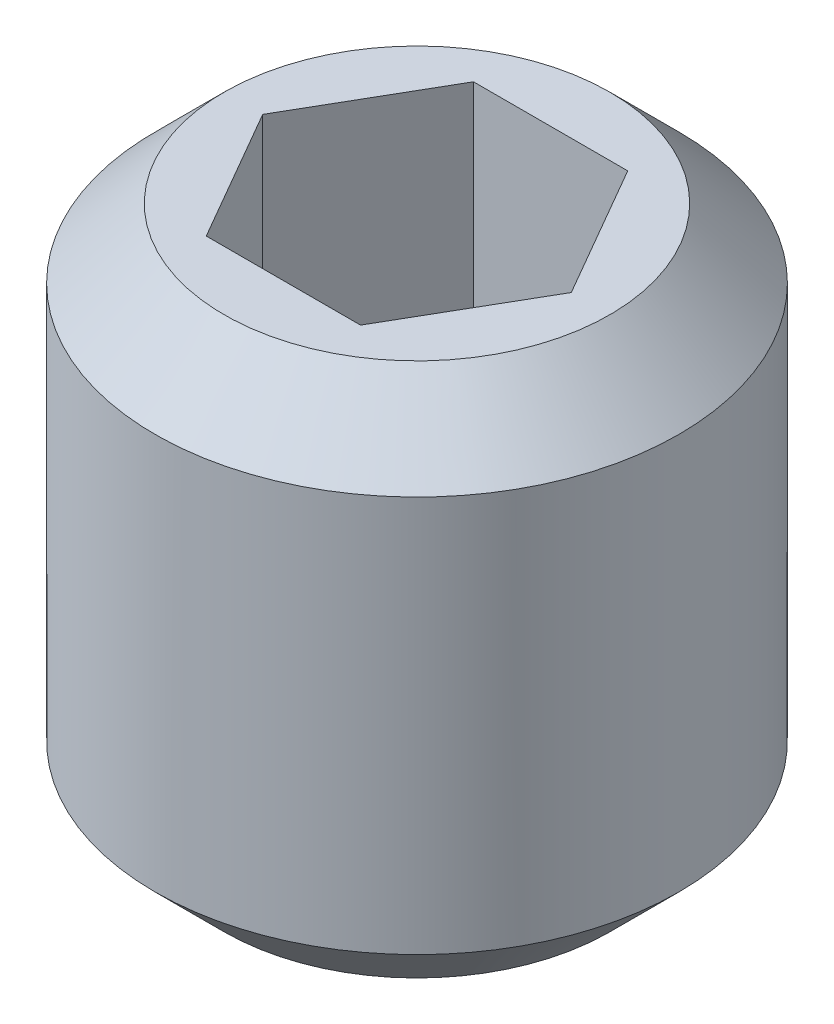
ISO-10303-21;
HEADER;
FILE_DESCRIPTION(('STEP AP214'),'2;1');
FILE_NAME('part.step','',(''),(''),'','','');
FILE_SCHEMA(('AUTOMOTIVE_DESIGN { 1 0 10303 214 1 1 1 1 }'));
ENDSEC;
DATA;
#1=APPLICATION_CONTEXT('core data for automotive mechanical design processes');
#2=APPLICATION_PROTOCOL_DEFINITION('international standard','automotive_design',2000,#1);
#3=PRODUCT_CONTEXT('',#1,'mechanical');
#4=PRODUCT('Part','Part','',(#3));
#5=PRODUCT_RELATED_PRODUCT_CATEGORY('part','',(#4));
#6=PRODUCT_DEFINITION_FORMATION('','',#4);
#7=PRODUCT_DEFINITION_CONTEXT('part definition',#1,'design');
#8=PRODUCT_DEFINITION('design','',#6,#7);
#9=PRODUCT_DEFINITION_SHAPE('','',#8);
#10=(LENGTH_UNIT() NAMED_UNIT(*) SI_UNIT(.MILLI.,.METRE.));
#11=(NAMED_UNIT(*) PLANE_ANGLE_UNIT() SI_UNIT($,.RADIAN.));
#12=(NAMED_UNIT(*) SI_UNIT($,.STERADIAN.) SOLID_ANGLE_UNIT());
#13=UNCERTAINTY_MEASURE_WITH_UNIT(LENGTH_MEASURE(1.E-05),#10,'distance_accuracy_value','');
#14=(GEOMETRIC_REPRESENTATION_CONTEXT(3) GLOBAL_UNCERTAINTY_ASSIGNED_CONTEXT((#13)) GLOBAL_UNIT_ASSIGNED_CONTEXT((#10,
#11,#12)) REPRESENTATION_CONTEXT('',''));
#15=CARTESIAN_POINT('',(0.,0.,0.));
#16=DIRECTION('',(0.,0.,1.));
#17=DIRECTION('',(1.,0.,0.));
#18=AXIS2_PLACEMENT_3D('',#15,#16,#17);
#19=CARTESIAN_POINT('',(1.44337567297407,8.99999999999999,4.99999999999999));
#20=DIRECTION('',(0.866025403784439,0.,-0.5));
#21=DIRECTION('',(-0.5,0.,-0.866025403784439));
#22=AXIS2_PLACEMENT_3D('',#19,#20,#21);
#23=PLANE('',#22);
#24=DIRECTION('',(0.,1.,0.));
#25=VECTOR('',#24,1.);
#26=CARTESIAN_POINT('',(0.721687836487036,8.99999999999999,3.75000000000001));
#27=LINE('',#26,#25);
#28=CARTESIAN_POINT('',(0.72168783648704,11.,3.75000000000001));
#29=VERTEX_POINT('',#28);
#30=CARTESIAN_POINT('',(0.72168783648704,8.99999999999999,3.75000000000001));
#31=VERTEX_POINT('',#30);
#32=EDGE_CURVE('E86',#29,#31,#27,.F.);
#33=ORIENTED_EDGE('',*,*,#32,.T.);
#34=DIRECTION('',(-0.5,0.,-0.866025403784439));
#35=VECTOR('',#34,1.);
#36=CARTESIAN_POINT('',(1.44337567297407,8.99999999999999,4.99999999999999));
#37=LINE('',#36,#35);
#38=CARTESIAN_POINT('',(1.44337567297407,8.99999999999999,4.99999999999999));
#39=VERTEX_POINT('',#38);
#40=EDGE_CURVE('E75',#39,#31,#37,.T.);
#41=ORIENTED_EDGE('',*,*,#40,.F.);
#42=DIRECTION('',(0.,1.,0.));
#43=VECTOR('',#42,1.);
#44=CARTESIAN_POINT('',(1.44337567297407,8.99999999999999,4.99999999999999));
#45=LINE('',#44,#43);
#46=CARTESIAN_POINT('',(1.44337567297407,11.,4.99999999999999));
#47=VERTEX_POINT('',#46);
#48=EDGE_CURVE('E94',#39,#47,#45,.T.);
#49=ORIENTED_EDGE('',*,*,#48,.T.);
#50=DIRECTION('',(-0.5,0.,-0.866025403784439));
#51=VECTOR('',#50,1.);
#52=CARTESIAN_POINT('',(1.44337567297407,11.,4.99999999999999));
#53=LINE('',#52,#51);
#54=EDGE_CURVE('E70',#29,#47,#53,.F.);
#55=ORIENTED_EDGE('',*,*,#54,.F.);
#56=EDGE_LOOP('',(#33,#41,#49,#55));
#57=FACE_BOUND('',#56,.T.);
#58=ADVANCED_FACE('F17',(#57),#23,.F.);
#59=CARTESIAN_POINT('',(0.721687836487036,8.99999999999999,3.75000000000001));
#60=DIRECTION('',(0.,0.,-1.));
#61=DIRECTION('',(-1.,0.,0.));
#62=AXIS2_PLACEMENT_3D('',#59,#60,#61);
#63=PLANE('',#62);
#64=DIRECTION('',(0.,1.,0.));
#65=VECTOR('',#64,1.);
#66=CARTESIAN_POINT('',(-0.721687836487028,8.99999999999999,3.75000000000001));
#67=LINE('',#66,#65);
#68=CARTESIAN_POINT('',(-0.721687836487028,11.,3.75000000000001));
#69=VERTEX_POINT('',#68);
#70=CARTESIAN_POINT('',(-0.721687836487028,8.99999999999999,3.75000000000001));
#71=VERTEX_POINT('',#70);
#72=EDGE_CURVE('E90',#69,#71,#67,.F.);
#73=ORIENTED_EDGE('',*,*,#72,.T.);
#74=DIRECTION('',(-1.,0.,0.));
#75=VECTOR('',#74,1.);
#76=CARTESIAN_POINT('',(0.721687836487036,8.99999999999999,3.75000000000001));
#77=LINE('',#76,#75);
#78=EDGE_CURVE('E79',#31,#71,#77,.T.);
#79=ORIENTED_EDGE('',*,*,#78,.F.);
#80=ORIENTED_EDGE('',*,*,#32,.F.);
#81=DIRECTION('',(-1.,0.,0.));
#82=VECTOR('',#81,1.);
#83=CARTESIAN_POINT('',(0.721687836487036,11.,3.75000000000001));
#84=LINE('',#83,#82);
#85=EDGE_CURVE('E92',#69,#29,#84,.F.);
#86=ORIENTED_EDGE('',*,*,#85,.F.);
#87=EDGE_LOOP('',(#73,#79,#80,#86));
#88=FACE_BOUND('',#87,.T.);
#89=ADVANCED_FACE('F89',(#88),#63,.F.);
#90=CARTESIAN_POINT('',(0.721687836487036,8.99999999999999,6.24999999999999));
#91=DIRECTION('',(0.866025403784439,0.,0.499999999999999));
#92=DIRECTION('',(0.499999999999999,0.,-0.866025403784439));
#93=AXIS2_PLACEMENT_3D('',#90,#91,#92);
#94=PLANE('',#93);
#95=ORIENTED_EDGE('',*,*,#48,.F.);
#96=DIRECTION('',(0.499999999999998,0.,-0.86602540378444));
#97=VECTOR('',#96,1.);
#98=CARTESIAN_POINT('',(0.721687836487036,8.99999999999999,6.24999999999999));
#99=LINE('',#98,#97);
#100=CARTESIAN_POINT('',(0.721687836487036,8.99999999999999,6.24999999999999));
#101=VERTEX_POINT('',#100);
#102=EDGE_CURVE('E82',#101,#39,#99,.T.);
#103=ORIENTED_EDGE('',*,*,#102,.F.);
#104=DIRECTION('',(0.,1.,0.));
#105=VECTOR('',#104,1.);
#106=CARTESIAN_POINT('',(0.721687836487036,8.99999999999999,6.24999999999999));
#107=LINE('',#106,#105);
#108=CARTESIAN_POINT('',(0.721687836487036,11.,6.24999999999999));
#109=VERTEX_POINT('',#108);
#110=EDGE_CURVE('E125',#101,#109,#107,.T.);
#111=ORIENTED_EDGE('',*,*,#110,.T.);
#112=DIRECTION('',(0.499999999999999,0.,-0.866025403784439));
#113=VECTOR('',#112,1.);
#114=CARTESIAN_POINT('',(0.721687836487036,11.,6.24999999999999));
#115=LINE('',#114,#113);
#116=EDGE_CURVE('E135',#47,#109,#115,.F.);
#117=ORIENTED_EDGE('',*,*,#116,.F.);
#118=EDGE_LOOP('',(#95,#103,#111,#117));
#119=FACE_BOUND('',#118,.T.);
#120=ADVANCED_FACE('F138',(#119),#94,.F.);
#121=CARTESIAN_POINT('',(-0.721687836487028,8.99999999999999,3.75000000000001));
#122=DIRECTION('',(-0.866025403784439,0.,-0.499999999999999));
#123=DIRECTION('',(-0.499999999999999,0.,0.866025403784439));
#124=AXIS2_PLACEMENT_3D('',#121,#122,#123);
#125=PLANE('',#124);
#126=DIRECTION('',(0.,1.,0.));
#127=VECTOR('',#126,1.);
#128=CARTESIAN_POINT('',(-1.44337567297406,8.99999999999999,4.99999999999999));
#129=LINE('',#128,#127);
#130=CARTESIAN_POINT('',(-1.44337567297406,11.,4.99999999999999));
#131=VERTEX_POINT('',#130);
#132=CARTESIAN_POINT('',(-1.44337567297405,8.99999999999999,4.99999999999999));
#133=VERTEX_POINT('',#132);
#134=EDGE_CURVE('E121',#131,#133,#129,.F.);
#135=ORIENTED_EDGE('',*,*,#134,.T.);
#136=DIRECTION('',(-0.500000000000006,0.,0.866025403784435));
#137=VECTOR('',#136,1.);
#138=CARTESIAN_POINT('',(-0.721687836487028,8.99999999999999,3.75000000000001));
#139=LINE('',#138,#137);
#140=EDGE_CURVE('E131',#71,#133,#139,.T.);
#141=ORIENTED_EDGE('',*,*,#140,.F.);
#142=ORIENTED_EDGE('',*,*,#72,.F.);
#143=DIRECTION('',(-0.499999999999999,0.,0.866025403784439));
#144=VECTOR('',#143,1.);
#145=CARTESIAN_POINT('',(-0.721687836487029,11.,3.75000000000001));
#146=LINE('',#145,#144);
#147=EDGE_CURVE('E35',#131,#69,#146,.F.);
#148=ORIENTED_EDGE('',*,*,#147,.F.);
#149=EDGE_LOOP('',(#135,#141,#142,#148));
#150=FACE_BOUND('',#149,.T.);
#151=ADVANCED_FACE('F144',(#150),#125,.F.);
#152=CARTESIAN_POINT('',(-2.16506350946109,8.99999999999999,6.24999999999999));
#153=DIRECTION('',(0.,1.,0.));
#154=DIRECTION('',(0.,0.,1.));
#155=AXIS2_PLACEMENT_3D('',#152,#153,#154);
#156=PLANE('',#155);
#157=ORIENTED_EDGE('',*,*,#40,.T.);
#158=ORIENTED_EDGE('',*,*,#78,.T.);
#159=ORIENTED_EDGE('',*,*,#140,.T.);
#160=DIRECTION('',(0.5,0.,0.866025403784439));
#161=VECTOR('',#160,1.);
#162=CARTESIAN_POINT('',(-1.44337567297406,8.99999999999999,4.99999999999999));
#163=LINE('',#162,#161);
#164=CARTESIAN_POINT('',(-0.721687836487028,8.99999999999999,6.24999999999999));
#165=VERTEX_POINT('',#164);
#166=EDGE_CURVE('E119',#133,#165,#163,.T.);
#167=ORIENTED_EDGE('',*,*,#166,.T.);
#168=DIRECTION('',(1.,0.,0.));
#169=VECTOR('',#168,1.);
#170=CARTESIAN_POINT('',(-0.721687836487028,8.99999999999999,6.24999999999999));
#171=LINE('',#170,#169);
#172=EDGE_CURVE('E128',#165,#101,#171,.T.);
#173=ORIENTED_EDGE('',*,*,#172,.T.);
#174=ORIENTED_EDGE('',*,*,#102,.T.);
#175=EDGE_LOOP('',(#157,#158,#159,#167,#173,#174));
#176=FACE_BOUND('',#175,.T.);
#177=ADVANCED_FACE('F76',(#176),#156,.T.);
#178=CARTESIAN_POINT('',(-0.721687836487028,8.99999999999999,6.24999999999999));
#179=DIRECTION('',(0.,0.,1.));
#180=DIRECTION('',(1.,0.,0.));
#181=AXIS2_PLACEMENT_3D('',#178,#179,#180);
#182=PLANE('',#181);
#183=ORIENTED_EDGE('',*,*,#110,.F.);
#184=ORIENTED_EDGE('',*,*,#172,.F.);
#185=DIRECTION('',(0.,1.,0.));
#186=VECTOR('',#185,1.);
#187=CARTESIAN_POINT('',(-0.721687836487026,8.99999999999999,6.24999999999999));
#188=LINE('',#187,#186);
#189=CARTESIAN_POINT('',(-0.721687836487028,11.,6.24999999999999));
#190=VERTEX_POINT('',#189);
#191=EDGE_CURVE('E112',#165,#190,#188,.T.);
#192=ORIENTED_EDGE('',*,*,#191,.T.);
#193=DIRECTION('',(1.,0.,0.));
#194=VECTOR('',#193,1.);
#195=CARTESIAN_POINT('',(-0.721687836487028,11.,6.24999999999999));
#196=LINE('',#195,#194);
#197=EDGE_CURVE('E123',#109,#190,#196,.F.);
#198=ORIENTED_EDGE('',*,*,#197,.F.);
#199=EDGE_LOOP('',(#183,#184,#192,#198));
#200=FACE_BOUND('',#199,.T.);
#201=ADVANCED_FACE('F149',(#200),#182,.F.);
#202=CARTESIAN_POINT('',(0.,6.00000000019918,4.99999999999999));
#203=DIRECTION('',(0.,-1.,0.));
#204=DIRECTION('',(0.,0.,-1.));
#205=AXIS2_PLACEMENT_3D('',#202,#203,#204);
#206=CONICAL_SURFACE('',#205,0.624999999843112,0.523598775353447);
#207=CARTESIAN_POINT('',(0.,6.00000000002865,4.99999999999999));
#208=DIRECTION('',(0.,-1.,0.));
#209=DIRECTION('',(0.,0.,-1.));
#210=AXIS2_PLACEMENT_3D('',#207,#208,#209);
#211=CIRCLE('',#210,0.624999999941568);
#212=CARTESIAN_POINT('',(0.,6.00000000002865,4.37500000005842));
#213=VERTEX_POINT('',#212);
#214=EDGE_CURVE('E20',#213,#213,#211,.T.);
#215=ORIENTED_EDGE('',*,*,#214,.T.);
#216=EDGE_LOOP('',(#215));
#217=FACE_BOUND('',#216,.T.);
#218=CARTESIAN_POINT('',(1.70530256582424E-10,7.08253175497475,4.99999999999999));
#219=VERTEX_POINT('',#218);
#220=VERTEX_LOOP('',#219);
#221=FACE_BOUND('',#220,.T.);
#222=ADVANCED_FACE('F151',(#217,#221),#206,.F.);
#223=CARTESIAN_POINT('',(-1.44337567297406,8.99999999999999,4.99999999999999));
#224=DIRECTION('',(-0.866025403784439,0.,0.5));
#225=DIRECTION('',(0.5,0.,0.866025403784439));
#226=AXIS2_PLACEMENT_3D('',#223,#224,#225);
#227=PLANE('',#226);
#228=ORIENTED_EDGE('',*,*,#191,.F.);
#229=ORIENTED_EDGE('',*,*,#166,.F.);
#230=ORIENTED_EDGE('',*,*,#134,.F.);
#231=DIRECTION('',(0.5,0.,0.866025403784439));
#232=VECTOR('',#231,1.);
#233=CARTESIAN_POINT('',(-1.44337567297406,11.,4.99999999999999));
#234=LINE('',#233,#232);
#235=EDGE_CURVE('E103',#131,#190,#234,.T.);
#236=ORIENTED_EDGE('',*,*,#235,.T.);
#237=EDGE_LOOP('',(#228,#229,#230,#236));
#238=FACE_BOUND('',#237,.T.);
#239=ADVANCED_FACE('F147',(#238),#227,.F.);
#240=CARTESIAN_POINT('',(-0.624999999999999,6.,4.99999999999999));
#241=DIRECTION('',(0.,1.,0.));
#242=DIRECTION('',(-1.,0.,0.));
#243=AXIS2_PLACEMENT_3D('',#240,#241,#242);
#244=PLANE('',#243);
#245=ORIENTED_EDGE('',*,*,#214,.F.);
#246=EDGE_LOOP('',(#245));
#247=FACE_BOUND('',#246,.T.);
#248=CARTESIAN_POINT('',(0.,6.00000000002865,4.99999999999999));
#249=DIRECTION('',(0.,1.,0.));
#250=DIRECTION('',(0.,0.,1.));
#251=AXIS2_PLACEMENT_3D('',#248,#249,#250);
#252=CIRCLE('',#251,1.80421959123578);
#253=CARTESIAN_POINT('',(0.,6.00000000002865,6.80421959123577));
#254=VERTEX_POINT('',#253);
#255=EDGE_CURVE('E101',#254,#254,#252,.T.);
#256=ORIENTED_EDGE('',*,*,#255,.F.);
#257=EDGE_LOOP('',(#256));
#258=FACE_BOUND('',#257,.T.);
#259=ADVANCED_FACE('F178',(#247,#258),#244,.F.);
#260=CARTESIAN_POINT('',(0.,11.,4.99999999999999));
#261=DIRECTION('',(0.,-1.,0.));
#262=DIRECTION('',(1.,0.,0.));
#263=AXIS2_PLACEMENT_3D('',#260,#261,#262);
#264=PLANE('',#263);
#265=ORIENTED_EDGE('',*,*,#147,.T.);
#266=ORIENTED_EDGE('',*,*,#85,.T.);
#267=ORIENTED_EDGE('',*,*,#54,.T.);
#268=ORIENTED_EDGE('',*,*,#116,.T.);
#269=ORIENTED_EDGE('',*,*,#197,.T.);
#270=ORIENTED_EDGE('',*,*,#235,.F.);
#271=EDGE_LOOP('',(#265,#266,#267,#268,#269,#270));
#272=FACE_BOUND('',#271,.T.);
#273=CARTESIAN_POINT('',(0.,11.0000000000241,4.99999999999999));
#274=DIRECTION('',(0.,-1.,0.));
#275=DIRECTION('',(0.,0.,-1.));
#276=AXIS2_PLACEMENT_3D('',#273,#274,#275);
#277=CIRCLE('',#276,1.80421959129262);
#278=CARTESIAN_POINT('',(0.,11.0000000000241,3.19578040870737));
#279=VERTEX_POINT('',#278);
#280=EDGE_CURVE('E99',#279,#279,#277,.T.);
#281=ORIENTED_EDGE('',*,*,#280,.F.);
#282=EDGE_LOOP('',(#281));
#283=FACE_BOUND('',#282,.T.);
#284=ADVANCED_FACE('F142',(#272,#283),#264,.F.);
#285=CARTESIAN_POINT('',(0.,6.64628040885873,4.99999999999999));
#286=DIRECTION('',(0.,1.,0.));
#287=DIRECTION('',(0.,0.,1.));
#288=AXIS2_PLACEMENT_3D('',#285,#286,#287);
#289=CONICAL_SURFACE('',#288,2.4505000001227,0.785398163441426);
#290=ORIENTED_EDGE('',*,*,#255,.T.);
#291=EDGE_LOOP('',(#290));
#292=FACE_BOUND('',#291,.T.);
#293=CARTESIAN_POINT('',(0.,6.64628040878242,4.99999999999999));
#294=DIRECTION('',(0.,-1.,0.));
#295=DIRECTION('',(1.,0.,0.));
#296=AXIS2_PLACEMENT_3D('',#293,#294,#295);
#297=CIRCLE('',#296,2.4505);
#298=CARTESIAN_POINT('',(2.4505,6.64628040878242,4.99999999999999));
#299=VERTEX_POINT('',#298);
#300=EDGE_CURVE('E26',#299,#299,#297,.F.);
#301=ORIENTED_EDGE('',*,*,#300,.F.);
#302=EDGE_LOOP('',(#301));
#303=FACE_BOUND('',#302,.T.);
#304=ADVANCED_FACE('F169',(#292,#303),#289,.T.);
#305=CARTESIAN_POINT('',(0.,10.3537195912509,4.99999999999999));
#306=DIRECTION('',(0.,-1.,0.));
#307=DIRECTION('',(0.,0.,-1.));
#308=AXIS2_PLACEMENT_3D('',#305,#306,#307);
#309=CONICAL_SURFACE('',#308,2.45050000006586,0.785398163397448);
#310=ORIENTED_EDGE('',*,*,#280,.T.);
#311=EDGE_LOOP('',(#310));
#312=FACE_BOUND('',#311,.T.);
#313=CARTESIAN_POINT('',(0.,10.3537195912176,4.99999999999999));
#314=DIRECTION('',(0.,-1.,0.));
#315=DIRECTION('',(1.,0.,0.));
#316=AXIS2_PLACEMENT_3D('',#313,#314,#315);
#317=CIRCLE('',#316,2.4505);
#318=CARTESIAN_POINT('',(2.4505,10.3537195912176,4.99999999999999));
#319=VERTEX_POINT('',#318);
#320=EDGE_CURVE('E11',#319,#319,#317,.T.);
#321=ORIENTED_EDGE('',*,*,#320,.F.);
#322=EDGE_LOOP('',(#321));
#323=FACE_BOUND('',#322,.T.);
#324=ADVANCED_FACE('F163',(#312,#323),#309,.T.);
#325=CARTESIAN_POINT('',(0.,7.08253175473056,4.99999999999999));
#326=DIRECTION('',(0.,-1.,0.));
#327=DIRECTION('',(1.,0.,0.));
#328=AXIS2_PLACEMENT_3D('',#325,#326,#327);
#329=CYLINDRICAL_SURFACE('',#328,2.4505);
#330=ORIENTED_EDGE('',*,*,#320,.T.);
#331=EDGE_LOOP('',(#330));
#332=FACE_BOUND('',#331,.T.);
#333=ORIENTED_EDGE('',*,*,#300,.T.);
#334=EDGE_LOOP('',(#333));
#335=FACE_BOUND('',#334,.T.);
#336=ADVANCED_FACE('F161',(#332,#335),#329,.T.);
#337=CLOSED_SHELL('',(#58,#89,#120,#151,#177,#201,#222,#239,#259,#284,#304,#324,#336));
#338=MANIFOLD_SOLID_BREP('B1',#337);
#339=ADVANCED_BREP_SHAPE_REPRESENTATION('',(#18,#338),#14);
#340=SHAPE_DEFINITION_REPRESENTATION(#9,#339);
ENDSEC;
END-ISO-10303-21;
